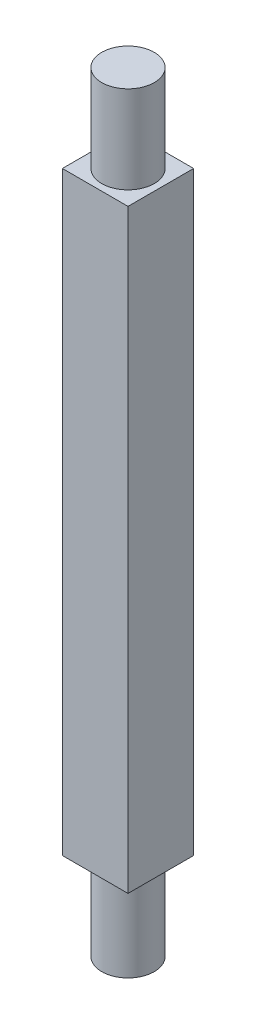
ISO-10303-21;
HEADER;
FILE_DESCRIPTION(('STEP AP214'),'2;1');
FILE_NAME('part.step','',(''),(''),'','','');
FILE_SCHEMA(('AUTOMOTIVE_DESIGN { 1 0 10303 214 1 1 1 1 }'));
ENDSEC;
DATA;
#1=APPLICATION_CONTEXT('core data for automotive mechanical design processes');
#2=APPLICATION_PROTOCOL_DEFINITION('international standard','automotive_design',2000,#1);
#3=PRODUCT_CONTEXT('',#1,'mechanical');
#4=PRODUCT('Part','Part','',(#3));
#5=PRODUCT_RELATED_PRODUCT_CATEGORY('part','',(#4));
#6=PRODUCT_DEFINITION_FORMATION('','',#4);
#7=PRODUCT_DEFINITION_CONTEXT('part definition',#1,'design');
#8=PRODUCT_DEFINITION('design','',#6,#7);
#9=PRODUCT_DEFINITION_SHAPE('','',#8);
#10=(LENGTH_UNIT() NAMED_UNIT(*) SI_UNIT(.MILLI.,.METRE.));
#11=(NAMED_UNIT(*) PLANE_ANGLE_UNIT() SI_UNIT($,.RADIAN.));
#12=(NAMED_UNIT(*) SI_UNIT($,.STERADIAN.) SOLID_ANGLE_UNIT());
#13=UNCERTAINTY_MEASURE_WITH_UNIT(LENGTH_MEASURE(1.E-05),#10,'distance_accuracy_value','');
#14=(GEOMETRIC_REPRESENTATION_CONTEXT(3) GLOBAL_UNCERTAINTY_ASSIGNED_CONTEXT((#13)) GLOBAL_UNIT_ASSIGNED_CONTEXT((#10,
#11,#12)) REPRESENTATION_CONTEXT('',''));
#15=CARTESIAN_POINT('',(0.,0.,0.));
#16=DIRECTION('',(0.,0.,1.));
#17=DIRECTION('',(1.,0.,0.));
#18=AXIS2_PLACEMENT_3D('',#15,#16,#17);
#19=CARTESIAN_POINT('',(7.5,136.,7.5));
#20=DIRECTION('',(0.,0.,1.));
#21=DIRECTION('',(1.,0.,0.));
#22=AXIS2_PLACEMENT_3D('',#19,#20,#21);
#23=PLANE('',#22);
#24=DIRECTION('',(-1.,0.,0.));
#25=VECTOR('',#24,1.);
#26=CARTESIAN_POINT('',(7.5,0.,7.5));
#27=LINE('',#26,#25);
#28=CARTESIAN_POINT('',(7.5,0.,7.5));
#29=VERTEX_POINT('',#28);
#30=CARTESIAN_POINT('',(-7.5,0.,7.5));
#31=VERTEX_POINT('',#30);
#32=EDGE_CURVE('E104',#29,#31,#27,.T.);
#33=ORIENTED_EDGE('',*,*,#32,.F.);
#34=DIRECTION('',(0.,-1.,0.));
#35=VECTOR('',#34,1.);
#36=CARTESIAN_POINT('',(7.5,136.,7.5));
#37=LINE('',#36,#35);
#38=CARTESIAN_POINT('',(7.5,136.,7.5));
#39=VERTEX_POINT('',#38);
#40=EDGE_CURVE('E53',#39,#29,#37,.T.);
#41=ORIENTED_EDGE('',*,*,#40,.F.);
#42=DIRECTION('',(-1.,0.,0.));
#43=VECTOR('',#42,1.);
#44=CARTESIAN_POINT('',(7.5,136.,7.5));
#45=LINE('',#44,#43);
#46=CARTESIAN_POINT('',(-7.5,136.,7.5));
#47=VERTEX_POINT('',#46);
#48=EDGE_CURVE('E98',#39,#47,#45,.T.);
#49=ORIENTED_EDGE('',*,*,#48,.T.);
#50=DIRECTION('',(0.,-1.,0.));
#51=VECTOR('',#50,1.);
#52=CARTESIAN_POINT('',(-7.5,136.,7.5));
#53=LINE('',#52,#51);
#54=EDGE_CURVE('E38',#47,#31,#53,.T.);
#55=ORIENTED_EDGE('',*,*,#54,.T.);
#56=EDGE_LOOP('',(#33,#41,#49,#55));
#57=FACE_BOUND('',#56,.T.);
#58=ADVANCED_FACE('F35',(#57),#23,.T.);
#59=CARTESIAN_POINT('',(7.5,136.,7.5));
#60=DIRECTION('',(-1.,0.,0.));
#61=DIRECTION('',(0.,0.,1.));
#62=AXIS2_PLACEMENT_3D('',#59,#60,#61);
#63=PLANE('',#62);
#64=DIRECTION('',(0.,0.,-1.));
#65=VECTOR('',#64,1.);
#66=CARTESIAN_POINT('',(7.5,0.,7.5));
#67=LINE('',#66,#65);
#68=CARTESIAN_POINT('',(7.5,0.,-7.5));
#69=VERTEX_POINT('',#68);
#70=EDGE_CURVE('E70',#29,#69,#67,.T.);
#71=ORIENTED_EDGE('',*,*,#70,.T.);
#72=DIRECTION('',(0.,-1.,0.));
#73=VECTOR('',#72,1.);
#74=CARTESIAN_POINT('',(7.5,136.,-7.5));
#75=LINE('',#74,#73);
#76=CARTESIAN_POINT('',(7.5,136.,-7.5));
#77=VERTEX_POINT('',#76);
#78=EDGE_CURVE('E96',#77,#69,#75,.T.);
#79=ORIENTED_EDGE('',*,*,#78,.F.);
#80=DIRECTION('',(0.,0.,-1.));
#81=VECTOR('',#80,1.);
#82=CARTESIAN_POINT('',(7.5,136.,7.5));
#83=LINE('',#82,#81);
#84=EDGE_CURVE('E87',#39,#77,#83,.T.);
#85=ORIENTED_EDGE('',*,*,#84,.F.);
#86=ORIENTED_EDGE('',*,*,#40,.T.);
#87=EDGE_LOOP('',(#71,#79,#85,#86));
#88=FACE_BOUND('',#87,.T.);
#89=ADVANCED_FACE('F116',(#88),#63,.F.);
#90=CARTESIAN_POINT('',(7.5,136.,-7.5));
#91=DIRECTION('',(0.,0.,1.));
#92=DIRECTION('',(1.,0.,0.));
#93=AXIS2_PLACEMENT_3D('',#90,#91,#92);
#94=PLANE('',#93);
#95=DIRECTION('',(-1.,0.,0.));
#96=VECTOR('',#95,1.);
#97=CARTESIAN_POINT('',(7.5,0.,-7.5));
#98=LINE('',#97,#96);
#99=CARTESIAN_POINT('',(-7.5,0.,-7.5));
#100=VERTEX_POINT('',#99);
#101=EDGE_CURVE('E94',#69,#100,#98,.T.);
#102=ORIENTED_EDGE('',*,*,#101,.T.);
#103=DIRECTION('',(0.,-1.,0.));
#104=VECTOR('',#103,1.);
#105=CARTESIAN_POINT('',(-7.5,136.,-7.5));
#106=LINE('',#105,#104);
#107=CARTESIAN_POINT('',(-7.5,136.,-7.5));
#108=VERTEX_POINT('',#107);
#109=EDGE_CURVE('E91',#108,#100,#106,.T.);
#110=ORIENTED_EDGE('',*,*,#109,.F.);
#111=DIRECTION('',(-1.,0.,0.));
#112=VECTOR('',#111,1.);
#113=CARTESIAN_POINT('',(7.5,136.,-7.5));
#114=LINE('',#113,#112);
#115=EDGE_CURVE('E82',#77,#108,#114,.T.);
#116=ORIENTED_EDGE('',*,*,#115,.F.);
#117=ORIENTED_EDGE('',*,*,#78,.T.);
#118=EDGE_LOOP('',(#102,#110,#116,#117));
#119=FACE_BOUND('',#118,.T.);
#120=ADVANCED_FACE('F92',(#119),#94,.F.);
#121=CARTESIAN_POINT('',(-7.5,136.,7.5));
#122=DIRECTION('',(-1.,0.,0.));
#123=DIRECTION('',(0.,0.,1.));
#124=AXIS2_PLACEMENT_3D('',#121,#122,#123);
#125=PLANE('',#124);
#126=DIRECTION('',(0.,0.,-1.));
#127=VECTOR('',#126,1.);
#128=CARTESIAN_POINT('',(-7.5,0.,7.5));
#129=LINE('',#128,#127);
#130=EDGE_CURVE('E107',#31,#100,#129,.T.);
#131=ORIENTED_EDGE('',*,*,#130,.F.);
#132=ORIENTED_EDGE('',*,*,#54,.F.);
#133=DIRECTION('',(0.,0.,-1.));
#134=VECTOR('',#133,1.);
#135=CARTESIAN_POINT('',(-7.5,136.,7.5));
#136=LINE('',#135,#134);
#137=EDGE_CURVE('E86',#47,#108,#136,.T.);
#138=ORIENTED_EDGE('',*,*,#137,.T.);
#139=ORIENTED_EDGE('',*,*,#109,.T.);
#140=EDGE_LOOP('',(#131,#132,#138,#139));
#141=FACE_BOUND('',#140,.T.);
#142=ADVANCED_FACE('F97',(#141),#125,.T.);
#143=CARTESIAN_POINT('',(0.,136.,0.));
#144=DIRECTION('',(0.,-1.,0.));
#145=DIRECTION('',(0.,0.,-1.));
#146=AXIS2_PLACEMENT_3D('',#143,#144,#145);
#147=PLANE('',#146);
#148=CARTESIAN_POINT('',(0.,136.,0.));
#149=DIRECTION('',(0.,1.,0.));
#150=DIRECTION('',(0.,0.,1.));
#151=AXIS2_PLACEMENT_3D('',#148,#149,#150);
#152=CIRCLE('',#151,6.);
#153=CARTESIAN_POINT('',(0.,136.,6.));
#154=VERTEX_POINT('',#153);
#155=EDGE_CURVE('E44',#154,#154,#152,.T.);
#156=ORIENTED_EDGE('',*,*,#155,.F.);
#157=EDGE_LOOP('',(#156));
#158=FACE_BOUND('',#157,.T.);
#159=ORIENTED_EDGE('',*,*,#48,.F.);
#160=ORIENTED_EDGE('',*,*,#84,.T.);
#161=ORIENTED_EDGE('',*,*,#115,.T.);
#162=ORIENTED_EDGE('',*,*,#137,.F.);
#163=EDGE_LOOP('',(#159,#160,#161,#162));
#164=FACE_BOUND('',#163,.T.);
#165=ADVANCED_FACE('F85',(#158,#164),#147,.F.);
#166=CARTESIAN_POINT('',(0.,0.,0.));
#167=DIRECTION('',(0.,-1.,0.));
#168=DIRECTION('',(0.,0.,-1.));
#169=AXIS2_PLACEMENT_3D('',#166,#167,#168);
#170=PLANE('',#169);
#171=CARTESIAN_POINT('',(0.,0.,0.));
#172=DIRECTION('',(0.,-1.,0.));
#173=DIRECTION('',(0.,0.,-1.));
#174=AXIS2_PLACEMENT_3D('',#171,#172,#173);
#175=CIRCLE('',#174,6.);
#176=CARTESIAN_POINT('',(0.,0.,-6.));
#177=VERTEX_POINT('',#176);
#178=EDGE_CURVE('E11',#177,#177,#175,.T.);
#179=ORIENTED_EDGE('',*,*,#178,.F.);
#180=EDGE_LOOP('',(#179));
#181=FACE_BOUND('',#180,.T.);
#182=ORIENTED_EDGE('',*,*,#32,.T.);
#183=ORIENTED_EDGE('',*,*,#130,.T.);
#184=ORIENTED_EDGE('',*,*,#101,.F.);
#185=ORIENTED_EDGE('',*,*,#70,.F.);
#186=EDGE_LOOP('',(#182,#183,#184,#185));
#187=FACE_BOUND('',#186,.T.);
#188=ADVANCED_FACE('F114',(#181,#187),#170,.T.);
#189=CARTESIAN_POINT('',(0.,156.,0.));
#190=DIRECTION('',(0.,-1.,0.));
#191=DIRECTION('',(0.,0.,-1.));
#192=AXIS2_PLACEMENT_3D('',#189,#190,#191);
#193=CYLINDRICAL_SURFACE('',#192,6.);
#194=CARTESIAN_POINT('',(0.,156.,0.));
#195=DIRECTION('',(0.,1.,0.));
#196=DIRECTION('',(0.,0.,1.));
#197=AXIS2_PLACEMENT_3D('',#194,#195,#196);
#198=CIRCLE('',#197,6.);
#199=CARTESIAN_POINT('',(0.,156.,6.));
#200=VERTEX_POINT('',#199);
#201=EDGE_CURVE('E108',#200,#200,#198,.T.);
#202=ORIENTED_EDGE('',*,*,#201,.F.);
#203=EDGE_LOOP('',(#202));
#204=FACE_BOUND('',#203,.T.);
#205=ORIENTED_EDGE('',*,*,#155,.T.);
#206=EDGE_LOOP('',(#205));
#207=FACE_BOUND('',#206,.T.);
#208=ADVANCED_FACE('F135',(#204,#207),#193,.T.);
#209=CARTESIAN_POINT('',(0.,156.,0.));
#210=DIRECTION('',(0.,1.,0.));
#211=DIRECTION('',(0.,0.,1.));
#212=AXIS2_PLACEMENT_3D('',#209,#210,#211);
#213=PLANE('',#212);
#214=ORIENTED_EDGE('',*,*,#201,.T.);
#215=EDGE_LOOP('',(#214));
#216=FACE_BOUND('',#215,.T.);
#217=ADVANCED_FACE('F141',(#216),#213,.T.);
#218=CARTESIAN_POINT('',(0.,-20.,0.));
#219=DIRECTION('',(0.,1.,0.));
#220=DIRECTION('',(0.,0.,1.));
#221=AXIS2_PLACEMENT_3D('',#218,#219,#220);
#222=CYLINDRICAL_SURFACE('',#221,6.);
#223=CARTESIAN_POINT('',(0.,-20.,0.));
#224=DIRECTION('',(0.,-1.,0.));
#225=DIRECTION('',(0.,0.,-1.));
#226=AXIS2_PLACEMENT_3D('',#223,#224,#225);
#227=CIRCLE('',#226,6.);
#228=CARTESIAN_POINT('',(0.,-20.,-6.));
#229=VERTEX_POINT('',#228);
#230=EDGE_CURVE('E157',#229,#229,#227,.T.);
#231=ORIENTED_EDGE('',*,*,#230,.F.);
#232=EDGE_LOOP('',(#231));
#233=FACE_BOUND('',#232,.T.);
#234=ORIENTED_EDGE('',*,*,#178,.T.);
#235=EDGE_LOOP('',(#234));
#236=FACE_BOUND('',#235,.T.);
#237=ADVANCED_FACE('F145',(#233,#236),#222,.T.);
#238=CARTESIAN_POINT('',(0.,-20.,0.));
#239=DIRECTION('',(0.,-1.,0.));
#240=DIRECTION('',(0.,0.,-1.));
#241=AXIS2_PLACEMENT_3D('',#238,#239,#240);
#242=PLANE('',#241);
#243=ORIENTED_EDGE('',*,*,#230,.T.);
#244=EDGE_LOOP('',(#243));
#245=FACE_BOUND('',#244,.T.);
#246=ADVANCED_FACE('F149',(#245),#242,.T.);
#247=CLOSED_SHELL('',(#58,#89,#120,#142,#165,#188,#208,#217,#237,#246));
#248=MANIFOLD_SOLID_BREP('B2',#247);
#249=ADVANCED_BREP_SHAPE_REPRESENTATION('',(#18,#248),#14);
#250=SHAPE_DEFINITION_REPRESENTATION(#9,#249);
ENDSEC;
END-ISO-10303-21;
